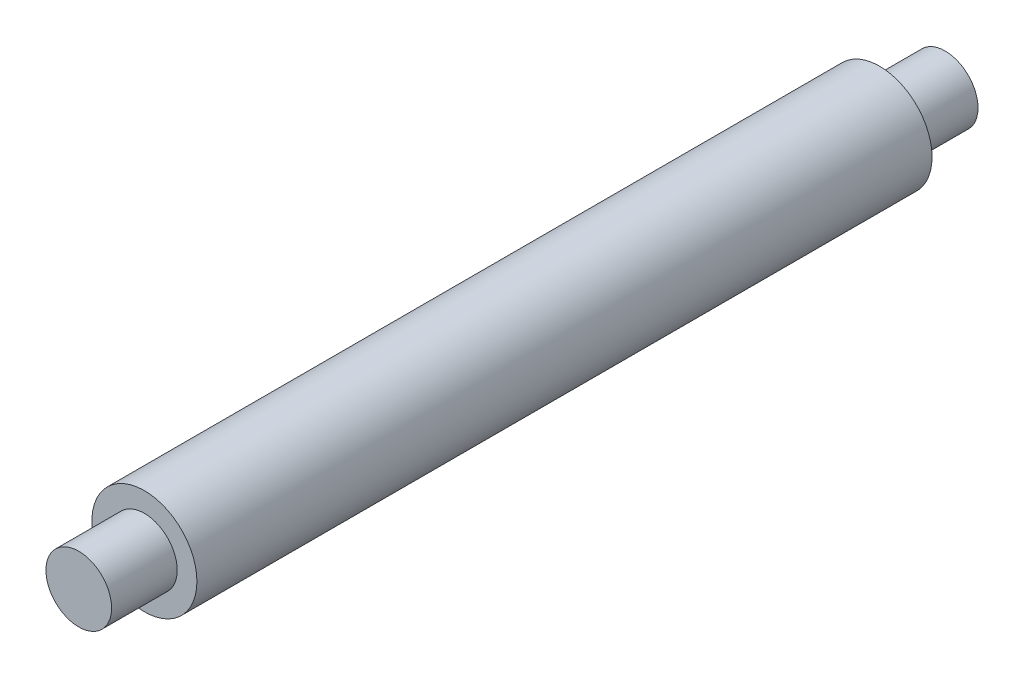
ISO-10303-21;
HEADER;
FILE_DESCRIPTION(('STEP AP214'),'2;1');
FILE_NAME('part.step','',(''),(''),'','','');
FILE_SCHEMA(('AUTOMOTIVE_DESIGN { 1 0 10303 214 1 1 1 1 }'));
ENDSEC;
DATA;
#1=APPLICATION_CONTEXT('core data for automotive mechanical design processes');
#2=APPLICATION_PROTOCOL_DEFINITION('international standard','automotive_design',2000,#1);
#3=PRODUCT_CONTEXT('',#1,'mechanical');
#4=PRODUCT('Part','Part','',(#3));
#5=PRODUCT_RELATED_PRODUCT_CATEGORY('part','',(#4));
#6=PRODUCT_DEFINITION_FORMATION('','',#4);
#7=PRODUCT_DEFINITION_CONTEXT('part definition',#1,'design');
#8=PRODUCT_DEFINITION('design','',#6,#7);
#9=PRODUCT_DEFINITION_SHAPE('','',#8);
#10=(LENGTH_UNIT() NAMED_UNIT(*) SI_UNIT(.MILLI.,.METRE.));
#11=(NAMED_UNIT(*) PLANE_ANGLE_UNIT() SI_UNIT($,.RADIAN.));
#12=(NAMED_UNIT(*) SI_UNIT($,.STERADIAN.) SOLID_ANGLE_UNIT());
#13=UNCERTAINTY_MEASURE_WITH_UNIT(LENGTH_MEASURE(1.E-05),#10,'distance_accuracy_value','');
#14=(GEOMETRIC_REPRESENTATION_CONTEXT(3) GLOBAL_UNCERTAINTY_ASSIGNED_CONTEXT((#13)) GLOBAL_UNIT_ASSIGNED_CONTEXT((#10,
#11,#12)) REPRESENTATION_CONTEXT('',''));
#15=CARTESIAN_POINT('',(0.,0.,0.));
#16=DIRECTION('',(0.,0.,1.));
#17=DIRECTION('',(1.,0.,0.));
#18=AXIS2_PLACEMENT_3D('',#15,#16,#17);
#19=CARTESIAN_POINT('',(0.,0.,56.));
#20=DIRECTION('',(0.,0.,-1.));
#21=DIRECTION('',(-1.,0.,0.));
#22=AXIS2_PLACEMENT_3D('',#19,#20,#21);
#23=CYLINDRICAL_SURFACE('',#22,4.);
#24=CARTESIAN_POINT('',(0.,0.,56.));
#25=DIRECTION('',(0.,0.,1.));
#26=DIRECTION('',(1.,0.,0.));
#27=AXIS2_PLACEMENT_3D('',#24,#25,#26);
#28=CIRCLE('',#27,4.);
#29=CARTESIAN_POINT('',(4.,0.,56.));
#30=VERTEX_POINT('',#29);
#31=EDGE_CURVE('E37',#30,#30,#28,.T.);
#32=ORIENTED_EDGE('',*,*,#31,.F.);
#33=EDGE_LOOP('',(#32));
#34=FACE_BOUND('',#33,.T.);
#35=CARTESIAN_POINT('',(0.,0.,0.));
#36=DIRECTION('',(0.,0.,1.));
#37=DIRECTION('',(1.,0.,0.));
#38=AXIS2_PLACEMENT_3D('',#35,#36,#37);
#39=CIRCLE('',#38,4.);
#40=CARTESIAN_POINT('',(4.,0.,0.));
#41=VERTEX_POINT('',#40);
#42=EDGE_CURVE('E41',#41,#41,#39,.T.);
#43=ORIENTED_EDGE('',*,*,#42,.T.);
#44=EDGE_LOOP('',(#43));
#45=FACE_BOUND('',#44,.T.);
#46=ADVANCED_FACE('F31',(#34,#45),#23,.T.);
#47=CARTESIAN_POINT('',(0.,0.,56.));
#48=DIRECTION('',(0.,0.,1.));
#49=DIRECTION('',(1.,0.,0.));
#50=AXIS2_PLACEMENT_3D('',#47,#48,#49);
#51=PLANE('',#50);
#52=CARTESIAN_POINT('',(0.,0.,56.));
#53=DIRECTION('',(0.,0.,1.));
#54=DIRECTION('',(1.,0.,0.));
#55=AXIS2_PLACEMENT_3D('',#52,#53,#54);
#56=CIRCLE('',#55,2.5);
#57=CARTESIAN_POINT('',(2.5,0.,56.));
#58=VERTEX_POINT('',#57);
#59=EDGE_CURVE('E48',#58,#58,#56,.T.);
#60=ORIENTED_EDGE('',*,*,#59,.F.);
#61=EDGE_LOOP('',(#60));
#62=FACE_BOUND('',#61,.T.);
#63=ORIENTED_EDGE('',*,*,#31,.T.);
#64=EDGE_LOOP('',(#63));
#65=FACE_BOUND('',#64,.T.);
#66=ADVANCED_FACE('F72',(#62,#65),#51,.T.);
#67=CARTESIAN_POINT('',(0.,0.,0.));
#68=DIRECTION('',(0.,0.,1.));
#69=DIRECTION('',(1.,0.,0.));
#70=AXIS2_PLACEMENT_3D('',#67,#68,#69);
#71=PLANE('',#70);
#72=CARTESIAN_POINT('',(0.,0.,0.));
#73=DIRECTION('',(0.,0.,1.));
#74=DIRECTION('',(1.,0.,0.));
#75=AXIS2_PLACEMENT_3D('',#72,#73,#74);
#76=CIRCLE('',#75,2.5);
#77=CARTESIAN_POINT('',(2.5,0.,0.));
#78=VERTEX_POINT('',#77);
#79=EDGE_CURVE('E10',#78,#78,#76,.F.);
#80=ORIENTED_EDGE('',*,*,#79,.F.);
#81=EDGE_LOOP('',(#80));
#82=FACE_BOUND('',#81,.T.);
#83=ORIENTED_EDGE('',*,*,#42,.F.);
#84=EDGE_LOOP('',(#83));
#85=FACE_BOUND('',#84,.T.);
#86=ADVANCED_FACE('F77',(#82,#85),#71,.F.);
#87=CARTESIAN_POINT('',(0.,0.,61.));
#88=DIRECTION('',(0.,0.,-1.));
#89=DIRECTION('',(-1.,0.,0.));
#90=AXIS2_PLACEMENT_3D('',#87,#88,#89);
#91=CYLINDRICAL_SURFACE('',#90,2.5);
#92=CARTESIAN_POINT('',(0.,0.,61.));
#93=DIRECTION('',(0.,0.,1.));
#94=DIRECTION('',(1.,0.,0.));
#95=AXIS2_PLACEMENT_3D('',#92,#93,#94);
#96=CIRCLE('',#95,2.5);
#97=CARTESIAN_POINT('',(2.5,0.,61.));
#98=VERTEX_POINT('',#97);
#99=EDGE_CURVE('E46',#98,#98,#96,.T.);
#100=ORIENTED_EDGE('',*,*,#99,.F.);
#101=EDGE_LOOP('',(#100));
#102=FACE_BOUND('',#101,.T.);
#103=ORIENTED_EDGE('',*,*,#59,.T.);
#104=EDGE_LOOP('',(#103));
#105=FACE_BOUND('',#104,.T.);
#106=ADVANCED_FACE('F68',(#102,#105),#91,.T.);
#107=CARTESIAN_POINT('',(0.,0.,61.));
#108=DIRECTION('',(0.,0.,1.));
#109=DIRECTION('',(1.,0.,0.));
#110=AXIS2_PLACEMENT_3D('',#107,#108,#109);
#111=PLANE('',#110);
#112=ORIENTED_EDGE('',*,*,#99,.T.);
#113=EDGE_LOOP('',(#112));
#114=FACE_BOUND('',#113,.T.);
#115=ADVANCED_FACE('F61',(#114),#111,.T.);
#116=CARTESIAN_POINT('',(0.,0.,-5.));
#117=DIRECTION('',(0.,0.,1.));
#118=DIRECTION('',(1.,0.,0.));
#119=AXIS2_PLACEMENT_3D('',#116,#117,#118);
#120=CYLINDRICAL_SURFACE('',#119,2.5);
#121=CARTESIAN_POINT('',(0.,0.,-5.));
#122=DIRECTION('',(0.,0.,-1.));
#123=DIRECTION('',(-1.,0.,0.));
#124=AXIS2_PLACEMENT_3D('',#121,#122,#123);
#125=CIRCLE('',#124,2.5);
#126=CARTESIAN_POINT('',(-2.5,0.,-5.));
#127=VERTEX_POINT('',#126);
#128=EDGE_CURVE('E51',#127,#127,#125,.T.);
#129=ORIENTED_EDGE('',*,*,#128,.F.);
#130=EDGE_LOOP('',(#129));
#131=FACE_BOUND('',#130,.T.);
#132=ORIENTED_EDGE('',*,*,#79,.T.);
#133=EDGE_LOOP('',(#132));
#134=FACE_BOUND('',#133,.T.);
#135=ADVANCED_FACE('F59',(#131,#134),#120,.T.);
#136=CARTESIAN_POINT('',(0.,0.,-5.));
#137=DIRECTION('',(0.,0.,-1.));
#138=DIRECTION('',(-1.,0.,0.));
#139=AXIS2_PLACEMENT_3D('',#136,#137,#138);
#140=PLANE('',#139);
#141=ORIENTED_EDGE('',*,*,#128,.T.);
#142=EDGE_LOOP('',(#141));
#143=FACE_BOUND('',#142,.T.);
#144=ADVANCED_FACE('F57',(#143),#140,.T.);
#145=CLOSED_SHELL('',(#46,#66,#86,#106,#115,#135,#144));
#146=MANIFOLD_SOLID_BREP('B2',#145);
#147=ADVANCED_BREP_SHAPE_REPRESENTATION('',(#18,#146),#14);
#148=SHAPE_DEFINITION_REPRESENTATION(#9,#147);
ENDSEC;
END-ISO-10303-21;
